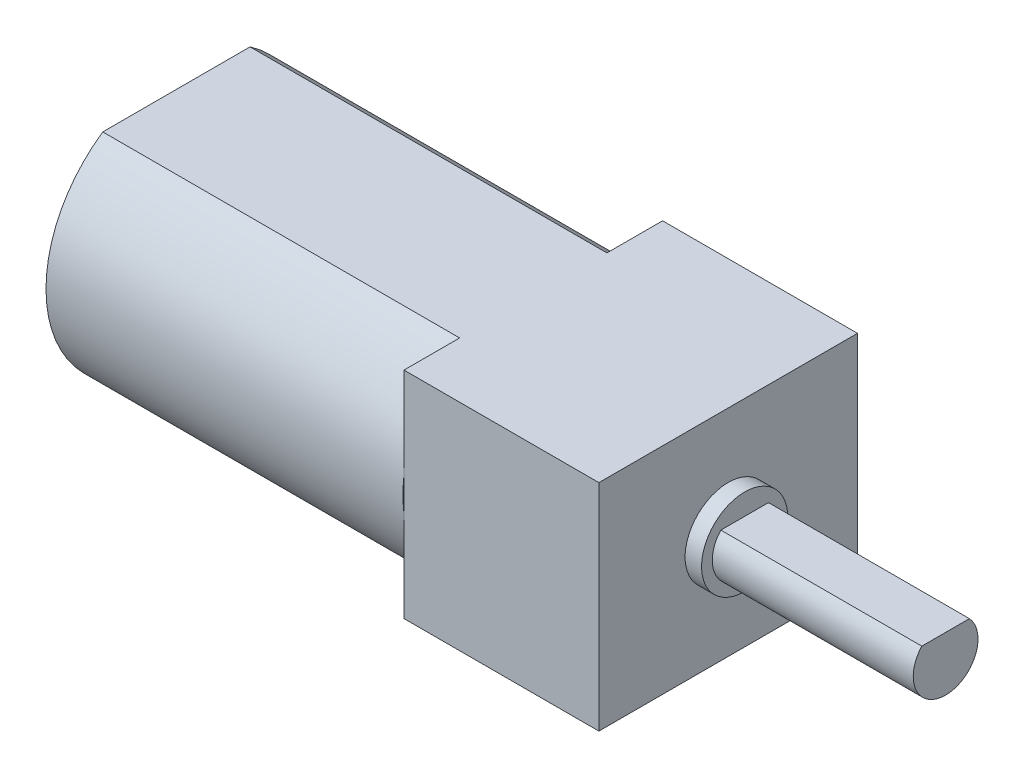
ISO-10303-21;
HEADER;
FILE_DESCRIPTION(('STEP AP214'),'2;1');
FILE_NAME('part.step','',(''),(''),'','','');
FILE_SCHEMA(('AUTOMOTIVE_DESIGN { 1 0 10303 214 1 1 1 1 }'));
ENDSEC;
DATA;
#1=APPLICATION_CONTEXT('core data for automotive mechanical design processes');
#2=APPLICATION_PROTOCOL_DEFINITION('international standard','automotive_design',2000,#1);
#3=PRODUCT_CONTEXT('',#1,'mechanical');
#4=PRODUCT('Part','Part','',(#3));
#5=PRODUCT_RELATED_PRODUCT_CATEGORY('part','',(#4));
#6=PRODUCT_DEFINITION_FORMATION('','',#4);
#7=PRODUCT_DEFINITION_CONTEXT('part definition',#1,'design');
#8=PRODUCT_DEFINITION('design','',#6,#7);
#9=PRODUCT_DEFINITION_SHAPE('','',#8);
#10=(LENGTH_UNIT() NAMED_UNIT(*) SI_UNIT(.MILLI.,.METRE.));
#11=(NAMED_UNIT(*) PLANE_ANGLE_UNIT() SI_UNIT($,.RADIAN.));
#12=(NAMED_UNIT(*) SI_UNIT($,.STERADIAN.) SOLID_ANGLE_UNIT());
#13=UNCERTAINTY_MEASURE_WITH_UNIT(LENGTH_MEASURE(1.E-05),#10,'distance_accuracy_value','');
#14=(GEOMETRIC_REPRESENTATION_CONTEXT(3) GLOBAL_UNCERTAINTY_ASSIGNED_CONTEXT((#13)) GLOBAL_UNIT_ASSIGNED_CONTEXT((#10,
#11,#12)) REPRESENTATION_CONTEXT('',''));
#15=CARTESIAN_POINT('',(0.,0.,0.));
#16=DIRECTION('',(0.,0.,1.));
#17=DIRECTION('',(1.,0.,0.));
#18=AXIS2_PLACEMENT_3D('',#15,#16,#17);
#19=CARTESIAN_POINT('',(-9.017,0.,0.));
#20=DIRECTION('',(1.,0.,0.));
#21=DIRECTION('',(0.,0.,-1.));
#22=AXIS2_PLACEMENT_3D('',#19,#20,#21);
#23=PLANE('',#22);
#24=CARTESIAN_POINT('',(-9.017,0.,0.));
#25=DIRECTION('',(-1.,0.,0.));
#26=DIRECTION('',(0.,0.,1.));
#27=AXIS2_PLACEMENT_3D('',#24,#25,#26);
#28=CIRCLE('',#27,6.0325);
#29=CARTESIAN_POINT('',(-9.017,4.9784,-3.40684453563705));
#30=VERTEX_POINT('',#29);
#31=CARTESIAN_POINT('',(-9.017,0.781230670160869,-5.9817));
#32=VERTEX_POINT('',#31);
#33=EDGE_CURVE('E44',#30,#32,#28,.T.);
#34=ORIENTED_EDGE('',*,*,#33,.F.);
#35=DIRECTION('',(0.,0.,1.));
#36=VECTOR('',#35,1.);
#37=CARTESIAN_POINT('',(-9.017,4.9784,5.9817));
#38=LINE('',#37,#36);
#39=CARTESIAN_POINT('',(-9.017,4.9784,-5.9817));
#40=VERTEX_POINT('',#39);
#41=EDGE_CURVE('E183',#40,#30,#38,.T.);
#42=ORIENTED_EDGE('',*,*,#41,.F.);
#43=DIRECTION('',(0.,1.,0.));
#44=VECTOR('',#43,1.);
#45=CARTESIAN_POINT('',(-9.017,4.9784,-5.9817));
#46=LINE('',#45,#44);
#47=EDGE_CURVE('E182',#32,#40,#46,.T.);
#48=ORIENTED_EDGE('',*,*,#47,.F.);
#49=EDGE_LOOP('',(#34,#42,#48));
#50=FACE_BOUND('',#49,.T.);
#51=ADVANCED_FACE('F33',(#50),#23,.F.);
#52=CARTESIAN_POINT('',(-9.017,-0.781230670160869,-5.9817));
#53=VERTEX_POINT('',#52);
#54=CARTESIAN_POINT('',(-9.017,-4.9784,-3.40684453563705));
#55=VERTEX_POINT('',#54);
#56=EDGE_CURVE('E11',#53,#55,#28,.T.);
#57=ORIENTED_EDGE('',*,*,#56,.F.);
#58=CARTESIAN_POINT('',(-9.017,-4.9784,-5.9817));
#59=VERTEX_POINT('',#58);
#60=EDGE_CURVE('E177',#59,#53,#46,.T.);
#61=ORIENTED_EDGE('',*,*,#60,.F.);
#62=DIRECTION('',(0.,0.,-1.));
#63=VECTOR('',#62,1.);
#64=CARTESIAN_POINT('',(-9.017,-4.9784,5.9817));
#65=LINE('',#64,#63);
#66=EDGE_CURVE('E188',#55,#59,#65,.T.);
#67=ORIENTED_EDGE('',*,*,#66,.F.);
#68=EDGE_LOOP('',(#57,#61,#67));
#69=FACE_BOUND('',#68,.T.);
#70=ADVANCED_FACE('F225',(#69),#23,.F.);
#71=CARTESIAN_POINT('',(-9.017,0.,0.));
#72=DIRECTION('',(-1.,0.,0.));
#73=DIRECTION('',(0.,0.,1.));
#74=AXIS2_PLACEMENT_3D('',#71,#72,#73);
#75=CIRCLE('',#74,6.0325);
#76=CARTESIAN_POINT('',(-9.017,-4.9784,3.40684453563705));
#77=VERTEX_POINT('',#76);
#78=CARTESIAN_POINT('',(-9.017,-0.78123067016087,5.9817));
#79=VERTEX_POINT('',#78);
#80=EDGE_CURVE('E147',#77,#79,#75,.T.);
#81=ORIENTED_EDGE('',*,*,#80,.F.);
#82=CARTESIAN_POINT('',(-9.017,-4.9784,5.9817));
#83=VERTEX_POINT('',#82);
#84=EDGE_CURVE('E190',#83,#77,#65,.T.);
#85=ORIENTED_EDGE('',*,*,#84,.F.);
#86=DIRECTION('',(0.,-1.,0.));
#87=VECTOR('',#86,1.);
#88=CARTESIAN_POINT('',(-9.017,4.9784,5.9817));
#89=LINE('',#88,#87);
#90=EDGE_CURVE('E59',#79,#83,#89,.T.);
#91=ORIENTED_EDGE('',*,*,#90,.F.);
#92=EDGE_LOOP('',(#81,#85,#91));
#93=FACE_BOUND('',#92,.T.);
#94=ADVANCED_FACE('F227',(#93),#23,.F.);
#95=CARTESIAN_POINT('',(0.,0.,0.));
#96=DIRECTION('',(1.,0.,0.));
#97=DIRECTION('',(0.,0.,-1.));
#98=AXIS2_PLACEMENT_3D('',#95,#96,#97);
#99=PLANE('',#98);
#100=CARTESIAN_POINT('',(0.,0.,0.));
#101=DIRECTION('',(1.,0.,0.));
#102=DIRECTION('',(0.,0.,-1.));
#103=AXIS2_PLACEMENT_3D('',#100,#101,#102);
#104=CIRCLE('',#103,1.9939);
#105=CARTESIAN_POINT('',(0.,0.,-1.9939));
#106=VERTEX_POINT('',#105);
#107=EDGE_CURVE('E151',#106,#106,#104,.T.);
#108=ORIENTED_EDGE('',*,*,#107,.F.);
#109=EDGE_LOOP('',(#108));
#110=FACE_BOUND('',#109,.T.);
#111=DIRECTION('',(0.,1.,0.));
#112=VECTOR('',#111,1.);
#113=CARTESIAN_POINT('',(0.,4.9784,-5.9817));
#114=LINE('',#113,#112);
#115=CARTESIAN_POINT('',(0.,-4.9784,-5.9817));
#116=VERTEX_POINT('',#115);
#117=CARTESIAN_POINT('',(0.,4.9784,-5.9817));
#118=VERTEX_POINT('',#117);
#119=EDGE_CURVE('E176',#116,#118,#114,.T.);
#120=ORIENTED_EDGE('',*,*,#119,.T.);
#121=DIRECTION('',(0.,0.,1.));
#122=VECTOR('',#121,1.);
#123=CARTESIAN_POINT('',(0.,4.9784,5.9817));
#124=LINE('',#123,#122);
#125=CARTESIAN_POINT('',(0.,4.9784,5.9817));
#126=VERTEX_POINT('',#125);
#127=EDGE_CURVE('E195',#118,#126,#124,.T.);
#128=ORIENTED_EDGE('',*,*,#127,.T.);
#129=DIRECTION('',(0.,-1.,0.));
#130=VECTOR('',#129,1.);
#131=CARTESIAN_POINT('',(0.,4.9784,5.9817));
#132=LINE('',#131,#130);
#133=CARTESIAN_POINT('',(0.,-4.9784,5.9817));
#134=VERTEX_POINT('',#133);
#135=EDGE_CURVE('E198',#126,#134,#132,.T.);
#136=ORIENTED_EDGE('',*,*,#135,.T.);
#137=DIRECTION('',(0.,0.,-1.));
#138=VECTOR('',#137,1.);
#139=CARTESIAN_POINT('',(0.,-4.9784,5.9817));
#140=LINE('',#139,#138);
#141=EDGE_CURVE('E201',#134,#116,#140,.T.);
#142=ORIENTED_EDGE('',*,*,#141,.T.);
#143=EDGE_LOOP('',(#120,#128,#136,#142));
#144=FACE_BOUND('',#143,.T.);
#145=ADVANCED_FACE('F220',(#110,#144),#99,.T.);
#146=CARTESIAN_POINT('',(-9.017,4.9784,-5.9817));
#147=DIRECTION('',(0.,0.,-1.));
#148=DIRECTION('',(-1.,0.,0.));
#149=AXIS2_PLACEMENT_3D('',#146,#147,#148);
#150=PLANE('',#149);
#151=ORIENTED_EDGE('',*,*,#119,.F.);
#152=DIRECTION('',(1.,0.,0.));
#153=VECTOR('',#152,1.);
#154=CARTESIAN_POINT('',(-9.017,-4.9784,-5.9817));
#155=LINE('',#154,#153);
#156=EDGE_CURVE('E204',#59,#116,#155,.T.);
#157=ORIENTED_EDGE('',*,*,#156,.F.);
#158=ORIENTED_EDGE('',*,*,#60,.T.);
#159=EDGE_CURVE('E181',#53,#32,#46,.T.);
#160=ORIENTED_EDGE('',*,*,#159,.T.);
#161=ORIENTED_EDGE('',*,*,#47,.T.);
#162=DIRECTION('',(1.,0.,0.));
#163=VECTOR('',#162,1.);
#164=CARTESIAN_POINT('',(-9.017,4.9784,-5.9817));
#165=LINE('',#164,#163);
#166=EDGE_CURVE('E192',#40,#118,#165,.T.);
#167=ORIENTED_EDGE('',*,*,#166,.T.);
#168=EDGE_LOOP('',(#151,#157,#158,#160,#161,#167));
#169=FACE_BOUND('',#168,.T.);
#170=ADVANCED_FACE('F35',(#169),#150,.T.);
#171=CARTESIAN_POINT('',(-9.017,-4.9784,5.9817));
#172=DIRECTION('',(0.,-1.,0.));
#173=DIRECTION('',(0.,0.,-1.));
#174=AXIS2_PLACEMENT_3D('',#171,#172,#173);
#175=PLANE('',#174);
#176=ORIENTED_EDGE('',*,*,#141,.F.);
#177=DIRECTION('',(1.,0.,0.));
#178=VECTOR('',#177,1.);
#179=CARTESIAN_POINT('',(-9.017,-4.9784,5.9817));
#180=LINE('',#179,#178);
#181=EDGE_CURVE('E206',#83,#134,#180,.T.);
#182=ORIENTED_EDGE('',*,*,#181,.F.);
#183=ORIENTED_EDGE('',*,*,#84,.T.);
#184=DIRECTION('',(1.,0.,0.));
#185=VECTOR('',#184,1.);
#186=CARTESIAN_POINT('',(-25.527,-4.9784,3.40684453563704));
#187=LINE('',#186,#185);
#188=CARTESIAN_POINT('',(-25.527,-4.9784,3.40684453563704));
#189=VERTEX_POINT('',#188);
#190=EDGE_CURVE('E134',#189,#77,#187,.T.);
#191=ORIENTED_EDGE('',*,*,#190,.F.);
#192=DIRECTION('',(0.,0.,1.));
#193=VECTOR('',#192,1.);
#194=CARTESIAN_POINT('',(-25.527,-4.9784,-3.40684453563705));
#195=LINE('',#194,#193);
#196=CARTESIAN_POINT('',(-25.527,-4.9784,-3.40684453563705));
#197=VERTEX_POINT('',#196);
#198=EDGE_CURVE('E126',#197,#189,#195,.T.);
#199=ORIENTED_EDGE('',*,*,#198,.F.);
#200=DIRECTION('',(1.,0.,0.));
#201=VECTOR('',#200,1.);
#202=CARTESIAN_POINT('',(-25.527,-4.9784,-3.40684453563705));
#203=LINE('',#202,#201);
#204=EDGE_CURVE('E131',#197,#55,#203,.T.);
#205=ORIENTED_EDGE('',*,*,#204,.T.);
#206=ORIENTED_EDGE('',*,*,#66,.T.);
#207=ORIENTED_EDGE('',*,*,#156,.T.);
#208=EDGE_LOOP('',(#176,#182,#183,#191,#199,#205,#206,#207));
#209=FACE_BOUND('',#208,.T.);
#210=ADVANCED_FACE('F129',(#209),#175,.T.);
#211=CARTESIAN_POINT('',(-9.017,4.9784,5.9817));
#212=DIRECTION('',(0.,0.,1.));
#213=DIRECTION('',(0.,-1.,0.));
#214=AXIS2_PLACEMENT_3D('',#211,#212,#213);
#215=PLANE('',#214);
#216=ORIENTED_EDGE('',*,*,#135,.F.);
#217=DIRECTION('',(1.,0.,0.));
#218=VECTOR('',#217,1.);
#219=CARTESIAN_POINT('',(-9.017,4.9784,5.9817));
#220=LINE('',#219,#218);
#221=CARTESIAN_POINT('',(-9.017,4.9784,5.9817));
#222=VERTEX_POINT('',#221);
#223=EDGE_CURVE('E208',#222,#126,#220,.T.);
#224=ORIENTED_EDGE('',*,*,#223,.F.);
#225=CARTESIAN_POINT('',(-9.017,0.781230670160869,5.9817));
#226=VERTEX_POINT('',#225);
#227=EDGE_CURVE('E185',#222,#226,#89,.T.);
#228=ORIENTED_EDGE('',*,*,#227,.T.);
#229=EDGE_CURVE('E189',#226,#79,#89,.T.);
#230=ORIENTED_EDGE('',*,*,#229,.T.);
#231=ORIENTED_EDGE('',*,*,#90,.T.);
#232=ORIENTED_EDGE('',*,*,#181,.T.);
#233=EDGE_LOOP('',(#216,#224,#228,#230,#231,#232));
#234=FACE_BOUND('',#233,.T.);
#235=ADVANCED_FACE('F246',(#234),#215,.T.);
#236=CARTESIAN_POINT('',(-9.017,4.9784,5.9817));
#237=DIRECTION('',(0.,1.,0.));
#238=DIRECTION('',(0.,0.,1.));
#239=AXIS2_PLACEMENT_3D('',#236,#237,#238);
#240=PLANE('',#239);
#241=ORIENTED_EDGE('',*,*,#127,.F.);
#242=ORIENTED_EDGE('',*,*,#166,.F.);
#243=ORIENTED_EDGE('',*,*,#41,.T.);
#244=DIRECTION('',(1.,0.,0.));
#245=VECTOR('',#244,1.);
#246=CARTESIAN_POINT('',(-25.527,4.9784,-3.40684453563705));
#247=LINE('',#246,#245);
#248=CARTESIAN_POINT('',(-25.527,4.9784,-3.40684453563705));
#249=VERTEX_POINT('',#248);
#250=EDGE_CURVE('E416',#249,#30,#247,.T.);
#251=ORIENTED_EDGE('',*,*,#250,.F.);
#252=DIRECTION('',(0.,0.,-1.));
#253=VECTOR('',#252,1.);
#254=CARTESIAN_POINT('',(-25.527,4.9784,-3.40684453563705));
#255=LINE('',#254,#253);
#256=CARTESIAN_POINT('',(-25.527,4.9784,3.40684453563705));
#257=VERTEX_POINT('',#256);
#258=EDGE_CURVE('E143',#257,#249,#255,.T.);
#259=ORIENTED_EDGE('',*,*,#258,.F.);
#260=DIRECTION('',(1.,0.,0.));
#261=VECTOR('',#260,1.);
#262=CARTESIAN_POINT('',(-25.527,4.9784,3.40684453563705));
#263=LINE('',#262,#261);
#264=CARTESIAN_POINT('',(-9.017,4.9784,3.40684453563705));
#265=VERTEX_POINT('',#264);
#266=EDGE_CURVE('E156',#257,#265,#263,.T.);
#267=ORIENTED_EDGE('',*,*,#266,.T.);
#268=EDGE_CURVE('E180',#265,#222,#38,.T.);
#269=ORIENTED_EDGE('',*,*,#268,.T.);
#270=ORIENTED_EDGE('',*,*,#223,.T.);
#271=EDGE_LOOP('',(#241,#242,#243,#251,#259,#267,#269,#270));
#272=FACE_BOUND('',#271,.T.);
#273=ADVANCED_FACE('F216',(#272),#240,.T.);
#274=EDGE_CURVE('E42',#226,#265,#75,.T.);
#275=ORIENTED_EDGE('',*,*,#274,.F.);
#276=ORIENTED_EDGE('',*,*,#227,.F.);
#277=ORIENTED_EDGE('',*,*,#268,.F.);
#278=EDGE_LOOP('',(#275,#276,#277));
#279=FACE_BOUND('',#278,.T.);
#280=ADVANCED_FACE('F233',(#279),#23,.F.);
#281=CARTESIAN_POINT('',(0.762,0.,0.));
#282=DIRECTION('',(1.,0.,0.));
#283=DIRECTION('',(0.,0.,-1.));
#284=AXIS2_PLACEMENT_3D('',#281,#282,#283);
#285=PLANE('',#284);
#286=CARTESIAN_POINT('',(0.762,0.,0.));
#287=DIRECTION('',(1.,0.,0.));
#288=DIRECTION('',(0.,0.,-1.));
#289=AXIS2_PLACEMENT_3D('',#286,#287,#288);
#290=CIRCLE('',#289,1.9939);
#291=CARTESIAN_POINT('',(0.762,0.,-1.9939));
#292=VERTEX_POINT('',#291);
#293=EDGE_CURVE('E154',#292,#292,#290,.T.);
#294=ORIENTED_EDGE('',*,*,#293,.T.);
#295=EDGE_LOOP('',(#294));
#296=FACE_BOUND('',#295,.T.);
#297=CARTESIAN_POINT('',(0.762000000000001,0.,0.));
#298=DIRECTION('',(1.,0.,0.));
#299=DIRECTION('',(0.,0.,-1.));
#300=AXIS2_PLACEMENT_3D('',#297,#298,#299);
#301=CIRCLE('',#300,1.4986);
#302=CARTESIAN_POINT('',(0.762000000000001,1.016,1.10161062086383));
#303=VERTEX_POINT('',#302);
#304=CARTESIAN_POINT('',(0.762000000000001,1.016,-1.10161062086383));
#305=VERTEX_POINT('',#304);
#306=EDGE_CURVE('E161',#303,#305,#301,.T.);
#307=ORIENTED_EDGE('',*,*,#306,.F.);
#308=DIRECTION('',(0.,0.,1.));
#309=VECTOR('',#308,1.);
#310=CARTESIAN_POINT('',(0.762000000000001,1.016,1.10161062086383));
#311=LINE('',#310,#309);
#312=EDGE_CURVE('E37',#305,#303,#311,.T.);
#313=ORIENTED_EDGE('',*,*,#312,.F.);
#314=EDGE_LOOP('',(#307,#313));
#315=FACE_BOUND('',#314,.T.);
#316=ADVANCED_FACE('F237',(#296,#315),#285,.T.);
#317=CARTESIAN_POINT('',(0.762,0.,0.));
#318=DIRECTION('',(-1.,0.,0.));
#319=DIRECTION('',(0.,0.,1.));
#320=AXIS2_PLACEMENT_3D('',#317,#318,#319);
#321=CYLINDRICAL_SURFACE('',#320,1.9939);
#322=ORIENTED_EDGE('',*,*,#293,.F.);
#323=EDGE_LOOP('',(#322));
#324=FACE_BOUND('',#323,.T.);
#325=ORIENTED_EDGE('',*,*,#107,.T.);
#326=EDGE_LOOP('',(#325));
#327=FACE_BOUND('',#326,.T.);
#328=ADVANCED_FACE('F265',(#324,#327),#321,.T.);
#329=CARTESIAN_POINT('',(10.0584,0.,0.));
#330=DIRECTION('',(1.,0.,0.));
#331=DIRECTION('',(0.,0.,-1.));
#332=AXIS2_PLACEMENT_3D('',#329,#330,#331);
#333=PLANE('',#332);
#334=CARTESIAN_POINT('',(10.0584,0.,0.));
#335=DIRECTION('',(1.,0.,0.));
#336=DIRECTION('',(0.,0.,-1.));
#337=AXIS2_PLACEMENT_3D('',#334,#335,#336);
#338=CIRCLE('',#337,1.4986);
#339=CARTESIAN_POINT('',(10.0584,1.016,1.10161062086383));
#340=VERTEX_POINT('',#339);
#341=CARTESIAN_POINT('',(10.0584,1.016,-1.10161062086383));
#342=VERTEX_POINT('',#341);
#343=EDGE_CURVE('E165',#340,#342,#338,.T.);
#344=ORIENTED_EDGE('',*,*,#343,.T.);
#345=DIRECTION('',(0.,0.,1.));
#346=VECTOR('',#345,1.);
#347=CARTESIAN_POINT('',(10.0584,1.016,1.10161062086383));
#348=LINE('',#347,#346);
#349=EDGE_CURVE('E168',#342,#340,#348,.T.);
#350=ORIENTED_EDGE('',*,*,#349,.T.);
#351=EDGE_LOOP('',(#344,#350));
#352=FACE_BOUND('',#351,.T.);
#353=ADVANCED_FACE('F274',(#352),#333,.T.);
#354=CARTESIAN_POINT('',(10.0584,1.016,1.10161062086383));
#355=DIRECTION('',(0.,-1.,0.));
#356=DIRECTION('',(0.,0.,-1.));
#357=AXIS2_PLACEMENT_3D('',#354,#355,#356);
#358=PLANE('',#357);
#359=DIRECTION('',(-1.,0.,0.));
#360=VECTOR('',#359,1.);
#361=CARTESIAN_POINT('',(10.0584,1.016,-1.10161062086383));
#362=LINE('',#361,#360);
#363=EDGE_CURVE('E173',#342,#305,#362,.T.);
#364=ORIENTED_EDGE('',*,*,#363,.T.);
#365=ORIENTED_EDGE('',*,*,#312,.T.);
#366=DIRECTION('',(-1.,0.,0.));
#367=VECTOR('',#366,1.);
#368=CARTESIAN_POINT('',(10.0584,1.016,1.10161062086383));
#369=LINE('',#368,#367);
#370=EDGE_CURVE('E170',#340,#303,#369,.T.);
#371=ORIENTED_EDGE('',*,*,#370,.F.);
#372=ORIENTED_EDGE('',*,*,#349,.F.);
#373=EDGE_LOOP('',(#364,#365,#371,#372));
#374=FACE_BOUND('',#373,.T.);
#375=ADVANCED_FACE('F283',(#374),#358,.F.);
#376=CARTESIAN_POINT('',(10.0584,0.,0.));
#377=DIRECTION('',(-1.,0.,0.));
#378=DIRECTION('',(0.,0.,1.));
#379=AXIS2_PLACEMENT_3D('',#376,#377,#378);
#380=CYLINDRICAL_SURFACE('',#379,1.4986);
#381=ORIENTED_EDGE('',*,*,#370,.T.);
#382=ORIENTED_EDGE('',*,*,#306,.T.);
#383=ORIENTED_EDGE('',*,*,#363,.F.);
#384=ORIENTED_EDGE('',*,*,#343,.F.);
#385=EDGE_LOOP('',(#381,#382,#383,#384));
#386=FACE_BOUND('',#385,.T.);
#387=ADVANCED_FACE('F239',(#386),#380,.T.);
#388=CARTESIAN_POINT('',(-9.017,0.,0.));
#389=DIRECTION('',(-1.,0.,0.));
#390=DIRECTION('',(0.,0.,1.));
#391=AXIS2_PLACEMENT_3D('',#388,#389,#390);
#392=PLANE('',#391);
#393=ORIENTED_EDGE('',*,*,#159,.F.);
#394=EDGE_CURVE('E45',#32,#53,#28,.T.);
#395=ORIENTED_EDGE('',*,*,#394,.F.);
#396=EDGE_LOOP('',(#393,#395));
#397=FACE_BOUND('',#396,.T.);
#398=ADVANCED_FACE('F296',(#397),#392,.F.);
#399=CARTESIAN_POINT('',(-25.527,0.,0.));
#400=DIRECTION('',(1.,0.,0.));
#401=DIRECTION('',(0.,0.,-1.));
#402=AXIS2_PLACEMENT_3D('',#399,#400,#401);
#403=CYLINDRICAL_SURFACE('',#402,6.0325);
#404=ORIENTED_EDGE('',*,*,#33,.T.);
#405=ORIENTED_EDGE('',*,*,#394,.T.);
#406=ORIENTED_EDGE('',*,*,#56,.T.);
#407=ORIENTED_EDGE('',*,*,#204,.F.);
#408=CARTESIAN_POINT('',(-25.527,0.,0.));
#409=DIRECTION('',(-1.,0.,0.));
#410=DIRECTION('',(0.,0.,1.));
#411=AXIS2_PLACEMENT_3D('',#408,#409,#410);
#412=CIRCLE('',#411,6.0325);
#413=EDGE_CURVE('E138',#249,#197,#412,.T.);
#414=ORIENTED_EDGE('',*,*,#413,.F.);
#415=ORIENTED_EDGE('',*,*,#250,.T.);
#416=EDGE_LOOP('',(#404,#405,#406,#407,#414,#415));
#417=FACE_BOUND('',#416,.T.);
#418=ADVANCED_FACE('F149',(#417),#403,.T.);
#419=CARTESIAN_POINT('',(-25.527,0.,0.));
#420=DIRECTION('',(1.,0.,0.));
#421=DIRECTION('',(0.,0.,-1.));
#422=AXIS2_PLACEMENT_3D('',#419,#420,#421);
#423=CYLINDRICAL_SURFACE('',#422,6.0325);
#424=ORIENTED_EDGE('',*,*,#80,.T.);
#425=EDGE_CURVE('E403',#79,#226,#75,.T.);
#426=ORIENTED_EDGE('',*,*,#425,.T.);
#427=ORIENTED_EDGE('',*,*,#274,.T.);
#428=ORIENTED_EDGE('',*,*,#266,.F.);
#429=CARTESIAN_POINT('',(-25.527,0.,0.));
#430=DIRECTION('',(-1.,0.,0.));
#431=DIRECTION('',(0.,0.,1.));
#432=AXIS2_PLACEMENT_3D('',#429,#430,#431);
#433=CIRCLE('',#432,6.0325);
#434=EDGE_CURVE('E137',#189,#257,#433,.T.);
#435=ORIENTED_EDGE('',*,*,#434,.F.);
#436=ORIENTED_EDGE('',*,*,#190,.T.);
#437=EDGE_LOOP('',(#424,#426,#427,#428,#435,#436));
#438=FACE_BOUND('',#437,.T.);
#439=ADVANCED_FACE('F311',(#438),#423,.T.);
#440=CARTESIAN_POINT('',(-25.527,0.,0.));
#441=DIRECTION('',(-1.,0.,0.));
#442=DIRECTION('',(0.,0.,1.));
#443=AXIS2_PLACEMENT_3D('',#440,#441,#442);
#444=PLANE('',#443);
#445=ORIENTED_EDGE('',*,*,#413,.T.);
#446=ORIENTED_EDGE('',*,*,#198,.T.);
#447=ORIENTED_EDGE('',*,*,#434,.T.);
#448=ORIENTED_EDGE('',*,*,#258,.T.);
#449=EDGE_LOOP('',(#445,#446,#447,#448));
#450=FACE_BOUND('',#449,.T.);
#451=ADVANCED_FACE('F141',(#450),#444,.T.);
#452=ORIENTED_EDGE('',*,*,#229,.F.);
#453=ORIENTED_EDGE('',*,*,#425,.F.);
#454=EDGE_LOOP('',(#452,#453));
#455=FACE_BOUND('',#454,.T.);
#456=ADVANCED_FACE('F305',(#455),#392,.F.);
#457=CLOSED_SHELL('',(#51,#70,#94,#145,#170,#210,#235,#273,#280,#316,#328,#353,#375,#387,#398,
#418,#439,#451,#456));
#458=MANIFOLD_SOLID_BREP('B2',#457);
#459=ADVANCED_BREP_SHAPE_REPRESENTATION('',(#18,#458),#14);
#460=SHAPE_DEFINITION_REPRESENTATION(#9,#459);
ENDSEC;
END-ISO-10303-21;
